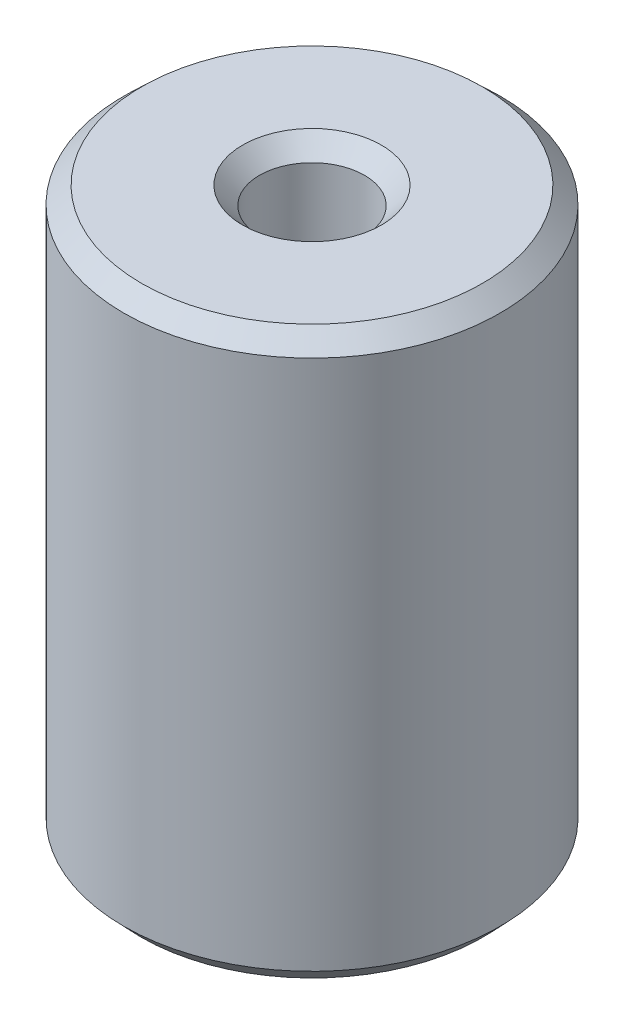
ISO-10303-21;
HEADER;
FILE_DESCRIPTION(('STEP AP214'),'2;1');
FILE_NAME('part.step','',(''),(''),'','','');
FILE_SCHEMA(('AUTOMOTIVE_DESIGN { 1 0 10303 214 1 1 1 1 }'));
ENDSEC;
DATA;
#1=APPLICATION_CONTEXT('core data for automotive mechanical design processes');
#2=APPLICATION_PROTOCOL_DEFINITION('international standard','automotive_design',2000,#1);
#3=PRODUCT_CONTEXT('',#1,'mechanical');
#4=PRODUCT('Part','Part','',(#3));
#5=PRODUCT_RELATED_PRODUCT_CATEGORY('part','',(#4));
#6=PRODUCT_DEFINITION_FORMATION('','',#4);
#7=PRODUCT_DEFINITION_CONTEXT('part definition',#1,'design');
#8=PRODUCT_DEFINITION('design','',#6,#7);
#9=PRODUCT_DEFINITION_SHAPE('','',#8);
#10=(LENGTH_UNIT() NAMED_UNIT(*) SI_UNIT(.MILLI.,.METRE.));
#11=(NAMED_UNIT(*) PLANE_ANGLE_UNIT() SI_UNIT($,.RADIAN.));
#12=(NAMED_UNIT(*) SI_UNIT($,.STERADIAN.) SOLID_ANGLE_UNIT());
#13=UNCERTAINTY_MEASURE_WITH_UNIT(LENGTH_MEASURE(1.E-05),#10,'distance_accuracy_value','');
#14=(GEOMETRIC_REPRESENTATION_CONTEXT(3) GLOBAL_UNCERTAINTY_ASSIGNED_CONTEXT((#13)) GLOBAL_UNIT_ASSIGNED_CONTEXT((#10,
#11,#12)) REPRESENTATION_CONTEXT('',''));
#15=CARTESIAN_POINT('',(0.,0.,0.));
#16=DIRECTION('',(0.,0.,1.));
#17=DIRECTION('',(1.,0.,0.));
#18=AXIS2_PLACEMENT_3D('',#15,#16,#17);
#19=CARTESIAN_POINT('',(0.,15.0362144505526,0.));
#20=DIRECTION('',(0.,-1.,0.));
#21=DIRECTION('',(0.,0.,-1.));
#22=AXIS2_PLACEMENT_3D('',#19,#20,#21);
#23=CYLINDRICAL_SURFACE('',#22,5.);
#24=CARTESIAN_POINT('',(0.,0.471160480828403,0.));
#25=DIRECTION('',(0.,1.,0.));
#26=DIRECTION('',(0.,0.,1.));
#27=AXIS2_PLACEMENT_3D('',#24,#25,#26);
#28=CIRCLE('',#27,5.);
#29=CARTESIAN_POINT('',(0.,0.471160480828403,5.));
#30=VERTEX_POINT('',#29);
#31=EDGE_CURVE('E10',#30,#30,#28,.T.);
#32=ORIENTED_EDGE('',*,*,#31,.T.);
#33=EDGE_LOOP('',(#32));
#34=FACE_BOUND('',#33,.T.);
#35=CARTESIAN_POINT('',(0.,14.587450164444,0.));
#36=DIRECTION('',(0.,1.,0.));
#37=DIRECTION('',(0.,0.,1.));
#38=AXIS2_PLACEMENT_3D('',#35,#36,#37);
#39=CIRCLE('',#38,5.);
#40=CARTESIAN_POINT('',(0.,14.587450164444,-5.));
#41=VERTEX_POINT('',#40);
#42=EDGE_CURVE('E50',#41,#41,#39,.F.);
#43=ORIENTED_EDGE('',*,*,#42,.T.);
#44=EDGE_LOOP('',(#43));
#45=FACE_BOUND('',#44,.T.);
#46=ADVANCED_FACE('F39',(#34,#45),#23,.T.);
#47=CARTESIAN_POINT('',(0.,15.0362144505526,0.));
#48=DIRECTION('',(0.,1.,0.));
#49=DIRECTION('',(0.,0.,1.));
#50=AXIS2_PLACEMENT_3D('',#47,#48,#49);
#51=PLANE('',#50);
#52=CARTESIAN_POINT('',(0.,15.0362144505526,0.));
#53=DIRECTION('',(0.,1.,0.));
#54=DIRECTION('',(0.,0.,1.));
#55=AXIS2_PLACEMENT_3D('',#52,#53,#54);
#56=CIRCLE('',#55,1.84422966210265);
#57=CARTESIAN_POINT('',(0.,15.0362144505526,1.84422966210265));
#58=VERTEX_POINT('',#57);
#59=EDGE_CURVE('E58',#58,#58,#56,.F.);
#60=ORIENTED_EDGE('',*,*,#59,.T.);
#61=EDGE_LOOP('',(#60));
#62=FACE_BOUND('',#61,.T.);
#63=CARTESIAN_POINT('',(0.,15.0362144505526,0.));
#64=DIRECTION('',(0.,1.,0.));
#65=DIRECTION('',(0.,0.,1.));
#66=AXIS2_PLACEMENT_3D('',#63,#64,#65);
#67=CIRCLE('',#66,4.5288395191716);
#68=CARTESIAN_POINT('',(0.,15.0362144505526,-4.5288395191716));
#69=VERTEX_POINT('',#68);
#70=EDGE_CURVE('E61',#69,#69,#67,.T.);
#71=ORIENTED_EDGE('',*,*,#70,.T.);
#72=EDGE_LOOP('',(#71));
#73=FACE_BOUND('',#72,.T.);
#74=ADVANCED_FACE('F88',(#62,#73),#51,.T.);
#75=CARTESIAN_POINT('',(0.,0.,0.));
#76=DIRECTION('',(0.,1.,0.));
#77=DIRECTION('',(0.,0.,1.));
#78=AXIS2_PLACEMENT_3D('',#75,#76,#77);
#79=PLANE('',#78);
#80=CARTESIAN_POINT('',(0.,0.,0.));
#81=DIRECTION('',(0.,1.,0.));
#82=DIRECTION('',(0.,0.,1.));
#83=AXIS2_PLACEMENT_3D('',#80,#81,#82);
#84=CIRCLE('',#83,1.86662585682243);
#85=CARTESIAN_POINT('',(0.,0.,-1.86662585682243));
#86=VERTEX_POINT('',#85);
#87=EDGE_CURVE('E51',#86,#86,#84,.T.);
#88=ORIENTED_EDGE('',*,*,#87,.T.);
#89=EDGE_LOOP('',(#88));
#90=FACE_BOUND('',#89,.T.);
#91=CARTESIAN_POINT('',(0.,0.,0.));
#92=DIRECTION('',(0.,1.,0.));
#93=DIRECTION('',(0.,0.,1.));
#94=AXIS2_PLACEMENT_3D('',#91,#92,#93);
#95=CIRCLE('',#94,4.55123571389138);
#96=CARTESIAN_POINT('',(0.,0.,4.55123571389138));
#97=VERTEX_POINT('',#96);
#98=EDGE_CURVE('E54',#97,#97,#95,.F.);
#99=ORIENTED_EDGE('',*,*,#98,.T.);
#100=EDGE_LOOP('',(#99));
#101=FACE_BOUND('',#100,.T.);
#102=ADVANCED_FACE('F83',(#90,#101),#79,.F.);
#103=CARTESIAN_POINT('',(0.,15.0362144505526,0.));
#104=DIRECTION('',(0.,-1.,0.));
#105=DIRECTION('',(0.,0.,-1.));
#106=AXIS2_PLACEMENT_3D('',#103,#104,#105);
#107=CYLINDRICAL_SURFACE('',#106,1.39546537599403);
#108=CARTESIAN_POINT('',(0.,14.5650539697242,0.));
#109=DIRECTION('',(0.,1.,0.));
#110=DIRECTION('',(0.,0.,1.));
#111=AXIS2_PLACEMENT_3D('',#108,#109,#110);
#112=CIRCLE('',#111,1.39546537599403);
#113=CARTESIAN_POINT('',(0.,14.5650539697242,1.39546537599403));
#114=VERTEX_POINT('',#113);
#115=EDGE_CURVE('E67',#114,#114,#112,.T.);
#116=ORIENTED_EDGE('',*,*,#115,.T.);
#117=EDGE_LOOP('',(#116));
#118=FACE_BOUND('',#117,.T.);
#119=CARTESIAN_POINT('',(0.,0.448764286108619,0.));
#120=DIRECTION('',(0.,1.,0.));
#121=DIRECTION('',(0.,0.,1.));
#122=AXIS2_PLACEMENT_3D('',#119,#120,#121);
#123=CIRCLE('',#122,1.39546537599403);
#124=CARTESIAN_POINT('',(0.,0.448764286108618,-1.39546537599403));
#125=VERTEX_POINT('',#124);
#126=EDGE_CURVE('E69',#125,#125,#123,.F.);
#127=ORIENTED_EDGE('',*,*,#126,.T.);
#128=EDGE_LOOP('',(#127));
#129=FACE_BOUND('',#128,.T.);
#130=ADVANCED_FACE('F71',(#118,#129),#107,.F.);
#131=CARTESIAN_POINT('',(0.,14.5650539697242,0.));
#132=DIRECTION('',(0.,1.,0.));
#133=DIRECTION('',(0.,0.,1.));
#134=AXIS2_PLACEMENT_3D('',#131,#132,#133);
#135=CONICAL_SURFACE('',#134,1.39546537599403,0.761057290898874);
#136=ORIENTED_EDGE('',*,*,#59,.F.);
#137=EDGE_LOOP('',(#136));
#138=FACE_BOUND('',#137,.T.);
#139=ORIENTED_EDGE('',*,*,#115,.F.);
#140=EDGE_LOOP('',(#139));
#141=FACE_BOUND('',#140,.T.);
#142=ADVANCED_FACE('F77',(#138,#141),#135,.F.);
#143=CARTESIAN_POINT('',(0.,0.,0.));
#144=DIRECTION('',(0.,-1.,0.));
#145=DIRECTION('',(0.,0.,-1.));
#146=AXIS2_PLACEMENT_3D('',#143,#144,#145);
#147=CONICAL_SURFACE('',#146,1.86662585682243,0.809739035896024);
#148=CARTESIAN_POINT('',(0.,0.448764286108618,-1.39546537599403));
#149=CARTESIAN_POINT('',(0.,0.44408965812832,-1.40037329766933));
#150=CARTESIAN_POINT('',(0.,0.439415030148022,-1.40528121934462));
#151=CARTESIAN_POINT('',(0.,0.430065774187426,-1.41509706269521));
#152=CARTESIAN_POINT('',(0.,0.425391146207128,-1.42000498437051));
#153=CARTESIAN_POINT('',(0.,0.416041890246532,-1.4298208277211));
#154=CARTESIAN_POINT('',(0.,0.411367262266234,-1.4347287493964));
#155=CARTESIAN_POINT('',(0.,0.402018006305637,-1.44454459274699));
#156=CARTESIAN_POINT('',(0.,0.397343378325339,-1.44945251442228));
#157=CARTESIAN_POINT('',(0.,0.387994122364743,-1.45926835777288));
#158=CARTESIAN_POINT('',(0.,0.383319494384445,-1.46417627944817));
#159=CARTESIAN_POINT('',(0.,0.373970238423849,-1.47399212279876));
#160=CARTESIAN_POINT('',(0.,0.369295610443551,-1.47890004447406));
#161=CARTESIAN_POINT('',(0.,0.359946354482954,-1.48871588782465));
#162=CARTESIAN_POINT('',(0.,0.355271726502656,-1.49362380949995));
#163=CARTESIAN_POINT('',(0.,0.34592247054206,-1.50343965285054));
#164=CARTESIAN_POINT('',(0.,0.341247842561762,-1.50834757452584));
#165=CARTESIAN_POINT('',(0.,0.331898586601166,-1.51816341787643));
#166=CARTESIAN_POINT('',(0.,0.327223958620868,-1.52307133955172));
#167=CARTESIAN_POINT('',(0.,0.317874702660271,-1.53288718290231));
#168=CARTESIAN_POINT('',(0.,0.313200074679973,-1.53779510457761));
#169=CARTESIAN_POINT('',(0.,0.303850818719377,-1.5476109479282));
#170=CARTESIAN_POINT('',(0.,0.299176190739079,-1.5525188696035));
#171=CARTESIAN_POINT('',(0.,0.289826934778483,-1.56233471295409));
#172=CARTESIAN_POINT('',(0.,0.285152306798185,-1.56724263462939));
#173=CARTESIAN_POINT('',(0.,0.275803050837588,-1.57705847797998));
#174=CARTESIAN_POINT('',(0.,0.27112842285729,-1.58196639965527));
#175=CARTESIAN_POINT('',(0.,0.261779166896694,-1.59178224300586));
#176=CARTESIAN_POINT('',(0.,0.257104538916396,-1.59669016468116));
#177=CARTESIAN_POINT('',(0.,0.2477552829558,-1.60650600803175));
#178=CARTESIAN_POINT('',(0.,0.243080654975502,-1.61141392970705));
#179=CARTESIAN_POINT('',(0.,0.233731399014905,-1.62122977305764));
#180=CARTESIAN_POINT('',(0.,0.229056771034607,-1.62613769473293));
#181=CARTESIAN_POINT('',(0.,0.219707515074011,-1.63595353808353));
#182=CARTESIAN_POINT('',(0.,0.215032887093713,-1.64086145975882));
#183=CARTESIAN_POINT('',(0.,0.205683631133117,-1.65067730310941));
#184=CARTESIAN_POINT('',(0.,0.201009003152819,-1.65558522478471));
#185=CARTESIAN_POINT('',(0.,0.191659747192222,-1.6654010681353));
#186=CARTESIAN_POINT('',(0.,0.186985119211924,-1.6703089898106));
#187=CARTESIAN_POINT('',(0.,0.177635863251328,-1.68012483316119));
#188=CARTESIAN_POINT('',(0.,0.17296123527103,-1.68503275483649));
#189=CARTESIAN_POINT('',(0.,0.163611979310434,-1.69484859818708));
#190=CARTESIAN_POINT('',(0.,0.158937351330136,-1.69975651986237));
#191=CARTESIAN_POINT('',(0.,0.149588095369539,-1.70957236321296));
#192=CARTESIAN_POINT('',(0.,0.144913467389241,-1.71448028488826));
#193=CARTESIAN_POINT('',(0.,0.135564211428645,-1.72429612823885));
#194=CARTESIAN_POINT('',(0.,0.130889583448347,-1.72920404991415));
#195=CARTESIAN_POINT('',(0.,0.121540327487751,-1.73901989326474));
#196=CARTESIAN_POINT('',(0.,0.116865699507453,-1.74392781494004));
#197=CARTESIAN_POINT('',(0.,0.107516443546856,-1.75374365829063));
#198=CARTESIAN_POINT('',(0.,0.102841815566558,-1.75865157996592));
#199=CARTESIAN_POINT('',(0.,0.0934925596059622,-1.76846742331651));
#200=CARTESIAN_POINT('',(0.,0.0888179316256641,-1.77337534499181));
#201=CARTESIAN_POINT('',(0.,0.0794686756650679,-1.7831911883424));
#202=CARTESIAN_POINT('',(0.,0.0747940476847697,-1.7880991100177));
#203=CARTESIAN_POINT('',(0.,0.0654447917241735,-1.79791495336829));
#204=CARTESIAN_POINT('',(0.,0.0607701637438754,-1.80282287504359));
#205=CARTESIAN_POINT('',(0.,0.0514209077832792,-1.81263871839418));
#206=CARTESIAN_POINT('',(0.,0.0467462798029811,-1.81754664006947));
#207=CARTESIAN_POINT('',(0.,0.0373970238423849,-1.82736248342006));
#208=CARTESIAN_POINT('',(0.,0.0327223958620868,-1.83227040509536));
#209=CARTESIAN_POINT('',(0.,0.0233731399014906,-1.84208624844595));
#210=CARTESIAN_POINT('',(0.,0.0186985119211924,-1.84699417012125));
#211=CARTESIAN_POINT('',(0.,0.00934925596059617,-1.85681001347184));
#212=CARTESIAN_POINT('',(0.,0.00467462798029804,-1.86171793514713));
#213=CARTESIAN_POINT('',(0.,0.,-1.86662585682243));
#214=B_SPLINE_CURVE_WITH_KNOTS('',3,(#148,#149,#150,#151,#152,#153,#154,#155,#156,#157,#158,
#159,#160,#161,#162,#163,#164,#165,#166,#167,#168,#169,#170,#171,#172,#173,#174,#175,#176,#177,
#178,#179,#180,#181,#182,#183,#184,#185,#186,#187,#188,#189,#190,#191,#192,#193,#194,#195,#196,
#197,#198,#199,#200,#201,#202,#203,#204,#205,#206,#207,#208,#209,#210,#211,#212,#213),
.UNSPECIFIED.,.F.,.F.,(4,2,2,2,2,2,2,2,2,2,2,2,2,2,2,2,2,2,2,2,2,2,2,2,2,2,2,2,2,2,2,2,4),(0.,
0.0203336808602185,0.0406673617204373,0.0610010425806558,0.0813347234408745,0.101668404301093,
0.122002085161312,0.142335766021531,0.162669446881749,0.183003127741968,0.203336808602187,
0.223670489462405,0.244004170322624,0.264337851182842,0.284671532043061,0.30500521290328,
0.325338893763498,0.345672574623717,0.366006255483936,0.386339936344154,0.406673617204373,
0.427007298064592,0.44734097892481,0.467674659785029,0.488008340645247,0.508342021505466,
0.528675702365685,0.549009383225903,0.569343064086122,0.58967674494634,0.610010425806559,
0.630344106666778,0.650677787526996),.UNSPECIFIED.);
#215=EDGE_CURVE('BSEAM73',#125,#86,#214,.T.);
#216=ORIENTED_EDGE('',*,*,#126,.F.);
#217=ORIENTED_EDGE('',*,*,#87,.F.);
#218=ORIENTED_EDGE('',*,*,#215,.T.);
#219=ORIENTED_EDGE('',*,*,#215,.F.);
#220=EDGE_LOOP('',(#216,#218,#217,#219));
#221=FACE_BOUND('',#220,.T.);
#222=ADVANCED_FACE('F73',(#221),#147,.F.);
#223=CARTESIAN_POINT('',(0.,0.471160480828403,0.));
#224=DIRECTION('',(0.,1.,0.));
#225=DIRECTION('',(0.,0.,1.));
#226=AXIS2_PLACEMENT_3D('',#223,#224,#225);
#227=CONICAL_SURFACE('',#226,5.,0.761057290898873);
#228=ORIENTED_EDGE('',*,*,#98,.F.);
#229=EDGE_LOOP('',(#228));
#230=FACE_BOUND('',#229,.T.);
#231=ORIENTED_EDGE('',*,*,#31,.F.);
#232=EDGE_LOOP('',(#231));
#233=FACE_BOUND('',#232,.T.);
#234=ADVANCED_FACE('F76',(#230,#233),#227,.T.);
#235=CARTESIAN_POINT('',(0.,15.0362144505526,0.));
#236=DIRECTION('',(0.,-1.,0.));
#237=DIRECTION('',(0.,0.,-1.));
#238=AXIS2_PLACEMENT_3D('',#235,#236,#237);
#239=CONICAL_SURFACE('',#238,4.5288395191716,0.809739035896024);
#240=CARTESIAN_POINT('',(0.,14.587450164444,-5.));
#241=CARTESIAN_POINT('',(0.,14.5921247924243,-4.9950920783247));
#242=CARTESIAN_POINT('',(0.,14.5967994204046,-4.99018415664941));
#243=CARTESIAN_POINT('',(0.,14.6061486763652,-4.98036831329882));
#244=CARTESIAN_POINT('',(0.,14.6108233043455,-4.97546039162352));
#245=CARTESIAN_POINT('',(0.,14.6201725603061,-4.96564454827293));
#246=CARTESIAN_POINT('',(0.,14.6248471882864,-4.96073662659763));
#247=CARTESIAN_POINT('',(0.,14.634196444247,-4.95092078324704));
#248=CARTESIAN_POINT('',(0.,14.6388710722273,-4.94601286157175));
#249=CARTESIAN_POINT('',(0.,14.6482203281879,-4.93619701822115));
#250=CARTESIAN_POINT('',(0.,14.6528949561682,-4.93128909654586));
#251=CARTESIAN_POINT('',(0.,14.6622442121288,-4.92147325319527));
#252=CARTESIAN_POINT('',(0.,14.6669188401091,-4.91656533151997));
#253=CARTESIAN_POINT('',(0.,14.6762680960697,-4.90674948816938));
#254=CARTESIAN_POINT('',(0.,14.68094272405,-4.90184156649408));
#255=CARTESIAN_POINT('',(0.,14.6902919800106,-4.89202572314349));
#256=CARTESIAN_POINT('',(0.,14.6949666079909,-4.8871178014682));
#257=CARTESIAN_POINT('',(0.,14.7043158639515,-4.8773019581176));
#258=CARTESIAN_POINT('',(0.,14.7089904919318,-4.87239403644231));
#259=CARTESIAN_POINT('',(0.,14.7183397478924,-4.86257819309172));
#260=CARTESIAN_POINT('',(0.,14.7230143758727,-4.85767027141642));
#261=CARTESIAN_POINT('',(0.,14.7323636318333,-4.84785442806583));
#262=CARTESIAN_POINT('',(0.,14.7370382598135,-4.84294650639053));
#263=CARTESIAN_POINT('',(0.,14.7463875157741,-4.83313066303994));
#264=CARTESIAN_POINT('',(0.,14.7510621437544,-4.82822274136465));
#265=CARTESIAN_POINT('',(0.,14.760411399715,-4.81840689801405));
#266=CARTESIAN_POINT('',(0.,14.7650860276953,-4.81349897633876));
#267=CARTESIAN_POINT('',(0.,14.7744352836559,-4.80368313298817));
#268=CARTESIAN_POINT('',(0.,14.7791099116362,-4.79877521131287));
#269=CARTESIAN_POINT('',(0.,14.7884591675968,-4.78895936796228));
#270=CARTESIAN_POINT('',(0.,14.7931337955771,-4.78405144628698));
#271=CARTESIAN_POINT('',(0.,14.8024830515377,-4.77423560293639));
#272=CARTESIAN_POINT('',(0.,14.807157679518,-4.7693276812611));
#273=CARTESIAN_POINT('',(0.,14.8165069354786,-4.7595118379105));
#274=CARTESIAN_POINT('',(0.,14.8211815634589,-4.75460391623521));
#275=CARTESIAN_POINT('',(0.,14.8305308194195,-4.74478807288462));
#276=CARTESIAN_POINT('',(0.,14.8352054473998,-4.73988015120932));
#277=CARTESIAN_POINT('',(0.,14.8445547033604,-4.73006430785873));
#278=CARTESIAN_POINT('',(0.,14.8492293313407,-4.72515638618343));
#279=CARTESIAN_POINT('',(0.,14.8585785873013,-4.71534054283284));
#280=CARTESIAN_POINT('',(0.,14.8632532152816,-4.71043262115754));
#281=CARTESIAN_POINT('',(0.,14.8726024712422,-4.70061677780695));
#282=CARTESIAN_POINT('',(0.,14.8772770992225,-4.69570885613166));
#283=CARTESIAN_POINT('',(0.,14.8866263551831,-4.68589301278106));
#284=CARTESIAN_POINT('',(0.,14.8913009831634,-4.68098509110577));
#285=CARTESIAN_POINT('',(0.,14.900650239124,-4.67116924775518));
#286=CARTESIAN_POINT('',(0.,14.9053248671043,-4.66626132607988));
#287=CARTESIAN_POINT('',(0.,14.9146741230649,-4.65644548272929));
#288=CARTESIAN_POINT('',(0.,14.9193487510452,-4.65153756105399));
#289=CARTESIAN_POINT('',(0.,14.9286980070058,-4.6417217177034));
#290=CARTESIAN_POINT('',(0.,14.9333726349861,-4.63681379602811));
#291=CARTESIAN_POINT('',(0.,14.9427218909467,-4.62699795267751));
#292=CARTESIAN_POINT('',(0.,14.947396518927,-4.62209003100222));
#293=CARTESIAN_POINT('',(0.,14.9567457748876,-4.61227418765163));
#294=CARTESIAN_POINT('',(0.,14.9614204028679,-4.60736626597633));
#295=CARTESIAN_POINT('',(0.,14.9707696588285,-4.59755042262574));
#296=CARTESIAN_POINT('',(0.,14.9754442868088,-4.59264250095044));
#297=CARTESIAN_POINT('',(0.,14.9847935427693,-4.58282665759985));
#298=CARTESIAN_POINT('',(0.,14.9894681707496,-4.57791873592456));
#299=CARTESIAN_POINT('',(0.,14.9988174267102,-4.56810289257396));
#300=CARTESIAN_POINT('',(0.,15.0034920546905,-4.56319497089867));
#301=CARTESIAN_POINT('',(0.,15.0128413106511,-4.55337912754808));
#302=CARTESIAN_POINT('',(0.,15.0175159386314,-4.54847120587278));
#303=CARTESIAN_POINT('',(0.,15.026865194592,-4.53865536252219));
#304=CARTESIAN_POINT('',(0.,15.0315398225723,-4.53374744084689));
#305=CARTESIAN_POINT('',(0.,15.0362144505526,-4.5288395191716));
#306=B_SPLINE_CURVE_WITH_KNOTS('',3,(#240,#241,#242,#243,#244,#245,#246,#247,#248,#249,#250,
#251,#252,#253,#254,#255,#256,#257,#258,#259,#260,#261,#262,#263,#264,#265,#266,#267,#268,#269,
#270,#271,#272,#273,#274,#275,#276,#277,#278,#279,#280,#281,#282,#283,#284,#285,#286,#287,#288,
#289,#290,#291,#292,#293,#294,#295,#296,#297,#298,#299,#300,#301,#302,#303,#304,#305),
.UNSPECIFIED.,.F.,.F.,(4,2,2,2,2,2,2,2,2,2,2,2,2,2,2,2,2,2,2,2,2,2,2,2,2,2,2,2,2,2,2,2,4),(0.,
0.0203336808602189,0.0406673617204378,0.0610010425806567,0.0813347234408756,0.101668404301094,
0.122002085161313,0.142335766021532,0.162669446881751,0.18300312774197,0.203336808602189,
0.223670489462407,0.244004170322626,0.264337851182844,0.284671532043063,0.305005212903282,
0.325338893763501,0.34567257462372,0.366006255483939,0.386339936344158,0.406673617204377,
0.427007298064596,0.447340978924814,0.467674659785033,0.488008340645252,0.50834202150547,
0.528675702365689,0.549009383225908,0.569343064086127,0.589676744946346,0.610010425806565,
0.630344106666784,0.650677787527003),.UNSPECIFIED.);
#307=EDGE_CURVE('BSEAM45',#41,#69,#306,.T.);
#308=ORIENTED_EDGE('',*,*,#42,.F.);
#309=ORIENTED_EDGE('',*,*,#70,.F.);
#310=ORIENTED_EDGE('',*,*,#307,.T.);
#311=ORIENTED_EDGE('',*,*,#307,.F.);
#312=EDGE_LOOP('',(#308,#310,#309,#311));
#313=FACE_BOUND('',#312,.T.);
#314=ADVANCED_FACE('F45',(#313),#239,.T.);
#315=CLOSED_SHELL('',(#46,#74,#102,#130,#142,#222,#234,#314));
#316=MANIFOLD_SOLID_BREP('B2',#315);
#317=ADVANCED_BREP_SHAPE_REPRESENTATION('',(#18,#316),#14);
#318=SHAPE_DEFINITION_REPRESENTATION(#9,#317);
ENDSEC;
END-ISO-10303-21;
